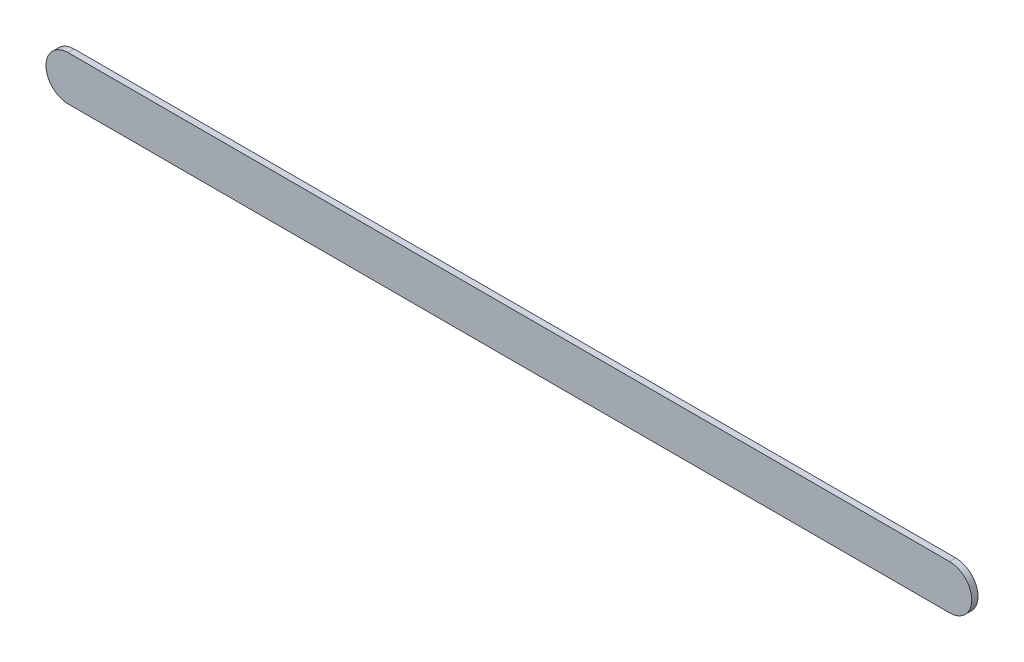
ISO-10303-21;
HEADER;
FILE_DESCRIPTION(('STEP AP214'),'2;1');
FILE_NAME('part.step','',(''),(''),'','','');
FILE_SCHEMA(('AUTOMOTIVE_DESIGN { 1 0 10303 214 1 1 1 1 }'));
ENDSEC;
DATA;
#1=APPLICATION_CONTEXT('core data for automotive mechanical design processes');
#2=APPLICATION_PROTOCOL_DEFINITION('international standard','automotive_design',2000,#1);
#3=PRODUCT_CONTEXT('',#1,'mechanical');
#4=PRODUCT('Part','Part','',(#3));
#5=PRODUCT_RELATED_PRODUCT_CATEGORY('part','',(#4));
#6=PRODUCT_DEFINITION_FORMATION('','',#4);
#7=PRODUCT_DEFINITION_CONTEXT('part definition',#1,'design');
#8=PRODUCT_DEFINITION('design','',#6,#7);
#9=PRODUCT_DEFINITION_SHAPE('','',#8);
#10=(LENGTH_UNIT() NAMED_UNIT(*) SI_UNIT(.MILLI.,.METRE.));
#11=(NAMED_UNIT(*) PLANE_ANGLE_UNIT() SI_UNIT($,.RADIAN.));
#12=(NAMED_UNIT(*) SI_UNIT($,.STERADIAN.) SOLID_ANGLE_UNIT());
#13=UNCERTAINTY_MEASURE_WITH_UNIT(LENGTH_MEASURE(1.E-05),#10,'distance_accuracy_value','');
#14=(GEOMETRIC_REPRESENTATION_CONTEXT(3) GLOBAL_UNCERTAINTY_ASSIGNED_CONTEXT((#13)) GLOBAL_UNIT_ASSIGNED_CONTEXT((#10,
#11,#12)) REPRESENTATION_CONTEXT('',''));
#15=CARTESIAN_POINT('',(0.,0.,0.));
#16=DIRECTION('',(0.,0.,1.));
#17=DIRECTION('',(1.,0.,0.));
#18=AXIS2_PLACEMENT_3D('',#15,#16,#17);
#19=CARTESIAN_POINT('',(85.67276236,71.15297174,0.));
#20=DIRECTION('',(0.,1.,0.));
#21=DIRECTION('',(1.,0.,0.));
#22=AXIS2_PLACEMENT_3D('',#19,#20,#21);
#23=PLANE('',#22);
#24=DIRECTION('',(1.,0.,0.));
#25=VECTOR('',#24,1.);
#26=CARTESIAN_POINT('',(85.67276236,71.15297174,0.03556));
#27=LINE('',#26,#25);
#28=CARTESIAN_POINT('',(85.67276236,71.15297174,0.03556));
#29=VERTEX_POINT('',#28);
#30=CARTESIAN_POINT('',(90.70997352,71.15297174,0.03556));
#31=VERTEX_POINT('',#30);
#32=EDGE_CURVE('E11',#29,#31,#27,.T.);
#33=ORIENTED_EDGE('',*,*,#32,.F.);
#34=DIRECTION('',(0.,0.,1.));
#35=VECTOR('',#34,1.);
#36=CARTESIAN_POINT('',(85.67276236,71.15297174,0.));
#37=LINE('',#36,#35);
#38=CARTESIAN_POINT('',(85.67276236,71.15297174,0.));
#39=VERTEX_POINT('',#38);
#40=EDGE_CURVE('E24',#39,#29,#37,.T.);
#41=ORIENTED_EDGE('',*,*,#40,.F.);
#42=DIRECTION('',(1.,0.,0.));
#43=VECTOR('',#42,1.);
#44=CARTESIAN_POINT('',(85.67276236,71.15297174,0.));
#45=LINE('',#44,#43);
#46=CARTESIAN_POINT('',(90.70997352,71.15297174,0.));
#47=VERTEX_POINT('',#46);
#48=EDGE_CURVE('E75',#39,#47,#45,.T.);
#49=ORIENTED_EDGE('',*,*,#48,.T.);
#50=DIRECTION('',(0.,0.,1.));
#51=VECTOR('',#50,1.);
#52=CARTESIAN_POINT('',(90.70997352,71.15297174,0.));
#53=LINE('',#52,#51);
#54=EDGE_CURVE('E37',#47,#31,#53,.T.);
#55=ORIENTED_EDGE('',*,*,#54,.T.);
#56=EDGE_LOOP('',(#33,#41,#49,#55));
#57=FACE_BOUND('',#56,.T.);
#58=ADVANCED_FACE('F17',(#57),#23,.F.);
#59=CARTESIAN_POINT('',(90.70997352,71.27997174,0.));
#60=DIRECTION('',(0.,0.,-1.));
#61=DIRECTION('',(0.,-1.,0.));
#62=AXIS2_PLACEMENT_3D('',#59,#60,#61);
#63=CYLINDRICAL_SURFACE('',#62,0.127);
#64=CARTESIAN_POINT('',(90.70997352,71.27997174,0.03556));
#65=DIRECTION('',(0.,0.,1.));
#66=DIRECTION('',(0.,-1.,0.));
#67=AXIS2_PLACEMENT_3D('',#64,#65,#66);
#68=CIRCLE('',#67,0.127);
#69=CARTESIAN_POINT('',(90.70997352,71.40697174,0.03556));
#70=VERTEX_POINT('',#69);
#71=EDGE_CURVE('E83',#31,#70,#68,.T.);
#72=ORIENTED_EDGE('',*,*,#71,.F.);
#73=ORIENTED_EDGE('',*,*,#54,.F.);
#74=CARTESIAN_POINT('',(90.70997352,71.27997174,0.));
#75=DIRECTION('',(0.,0.,1.));
#76=DIRECTION('',(0.,-1.,0.));
#77=AXIS2_PLACEMENT_3D('',#74,#75,#76);
#78=CIRCLE('',#77,0.127);
#79=CARTESIAN_POINT('',(90.70997352,71.40697174,0.));
#80=VERTEX_POINT('',#79);
#81=EDGE_CURVE('E81',#47,#80,#78,.T.);
#82=ORIENTED_EDGE('',*,*,#81,.T.);
#83=DIRECTION('',(0.,0.,1.));
#84=VECTOR('',#83,1.);
#85=CARTESIAN_POINT('',(90.70997352,71.40697174,0.));
#86=LINE('',#85,#84);
#87=EDGE_CURVE('E67',#80,#70,#86,.T.);
#88=ORIENTED_EDGE('',*,*,#87,.T.);
#89=EDGE_LOOP('',(#72,#73,#82,#88));
#90=FACE_BOUND('',#89,.T.);
#91=ADVANCED_FACE('F89',(#90),#63,.T.);
#92=CARTESIAN_POINT('',(90.70997352,71.40697174,0.));
#93=DIRECTION('',(0.,-1.,0.));
#94=DIRECTION('',(-1.,0.,0.));
#95=AXIS2_PLACEMENT_3D('',#92,#93,#94);
#96=PLANE('',#95);
#97=DIRECTION('',(-1.,0.,0.));
#98=VECTOR('',#97,1.);
#99=CARTESIAN_POINT('',(90.70997352,71.40697174,0.03556));
#100=LINE('',#99,#98);
#101=CARTESIAN_POINT('',(85.67276236,71.40697174,0.03556));
#102=VERTEX_POINT('',#101);
#103=EDGE_CURVE('E71',#70,#102,#100,.T.);
#104=ORIENTED_EDGE('',*,*,#103,.F.);
#105=ORIENTED_EDGE('',*,*,#87,.F.);
#106=DIRECTION('',(-1.,0.,0.));
#107=VECTOR('',#106,1.);
#108=CARTESIAN_POINT('',(90.70997352,71.40697174,0.));
#109=LINE('',#108,#107);
#110=CARTESIAN_POINT('',(85.67276236,71.40697174,0.));
#111=VERTEX_POINT('',#110);
#112=EDGE_CURVE('E63',#80,#111,#109,.T.);
#113=ORIENTED_EDGE('',*,*,#112,.T.);
#114=DIRECTION('',(0.,0.,1.));
#115=VECTOR('',#114,1.);
#116=CARTESIAN_POINT('',(85.67276236,71.40697174,0.));
#117=LINE('',#116,#115);
#118=EDGE_CURVE('E53',#111,#102,#117,.T.);
#119=ORIENTED_EDGE('',*,*,#118,.T.);
#120=EDGE_LOOP('',(#104,#105,#113,#119));
#121=FACE_BOUND('',#120,.T.);
#122=ADVANCED_FACE('F66',(#121),#96,.F.);
#123=CARTESIAN_POINT('',(85.67276236,71.27997174,0.));
#124=DIRECTION('',(0.,0.,-1.));
#125=DIRECTION('',(-1.11896493820492E-13,1.,0.));
#126=AXIS2_PLACEMENT_3D('',#123,#124,#125);
#127=CYLINDRICAL_SURFACE('',#126,0.127000000000005);
#128=CARTESIAN_POINT('',(85.67276236,71.27997174,0.03556));
#129=DIRECTION('',(0.,0.,1.));
#130=DIRECTION('',(-1.11896493820492E-13,1.,0.));
#131=AXIS2_PLACEMENT_3D('',#128,#129,#130);
#132=CIRCLE('',#131,0.127000000000005);
#133=EDGE_CURVE('E59',#102,#29,#132,.T.);
#134=ORIENTED_EDGE('',*,*,#133,.F.);
#135=ORIENTED_EDGE('',*,*,#118,.F.);
#136=CARTESIAN_POINT('',(85.67276236,71.27997174,0.));
#137=DIRECTION('',(0.,0.,1.));
#138=DIRECTION('',(-1.11896493820492E-13,1.,0.));
#139=AXIS2_PLACEMENT_3D('',#136,#137,#138);
#140=CIRCLE('',#139,0.127000000000005);
#141=EDGE_CURVE('E57',#111,#39,#140,.T.);
#142=ORIENTED_EDGE('',*,*,#141,.T.);
#143=ORIENTED_EDGE('',*,*,#40,.T.);
#144=EDGE_LOOP('',(#134,#135,#142,#143));
#145=FACE_BOUND('',#144,.T.);
#146=ADVANCED_FACE('F55',(#145),#127,.T.);
#147=CARTESIAN_POINT('',(85.67276236,71.15297174,0.));
#148=DIRECTION('',(0.,0.,-1.));
#149=DIRECTION('',(-1.,0.,0.));
#150=AXIS2_PLACEMENT_3D('',#147,#148,#149);
#151=PLANE('',#150);
#152=ORIENTED_EDGE('',*,*,#141,.F.);
#153=ORIENTED_EDGE('',*,*,#112,.F.);
#154=ORIENTED_EDGE('',*,*,#81,.F.);
#155=ORIENTED_EDGE('',*,*,#48,.F.);
#156=EDGE_LOOP('',(#152,#153,#154,#155));
#157=FACE_BOUND('',#156,.T.);
#158=ADVANCED_FACE('F74',(#157),#151,.T.);
#159=CARTESIAN_POINT('',(85.67276236,71.15297174,0.03556));
#160=DIRECTION('',(0.,0.,-1.));
#161=DIRECTION('',(-1.,0.,0.));
#162=AXIS2_PLACEMENT_3D('',#159,#160,#161);
#163=PLANE('',#162);
#164=ORIENTED_EDGE('',*,*,#32,.T.);
#165=ORIENTED_EDGE('',*,*,#71,.T.);
#166=ORIENTED_EDGE('',*,*,#103,.T.);
#167=ORIENTED_EDGE('',*,*,#133,.T.);
#168=EDGE_LOOP('',(#164,#165,#166,#167));
#169=FACE_BOUND('',#168,.T.);
#170=ADVANCED_FACE('F91',(#169),#163,.F.);
#171=CLOSED_SHELL('',(#58,#91,#122,#146,#158,#170));
#172=MANIFOLD_SOLID_BREP('B1',#171);
#173=ADVANCED_BREP_SHAPE_REPRESENTATION('',(#18,#172),#14);
#174=SHAPE_DEFINITION_REPRESENTATION(#9,#173);
ENDSEC;
END-ISO-10303-21;
